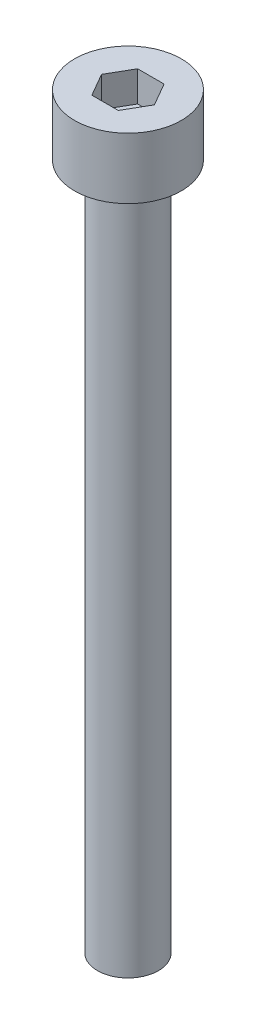
ISO-10303-21;
HEADER;
FILE_DESCRIPTION(('STEP AP214'),'2;1');
FILE_NAME('part.step','',(''),(''),'','','');
FILE_SCHEMA(('AUTOMOTIVE_DESIGN { 1 0 10303 214 1 1 1 1 }'));
ENDSEC;
DATA;
#1=APPLICATION_CONTEXT('core data for automotive mechanical design processes');
#2=APPLICATION_PROTOCOL_DEFINITION('international standard','automotive_design',2000,#1);
#3=PRODUCT_CONTEXT('',#1,'mechanical');
#4=PRODUCT('Part','Part','',(#3));
#5=PRODUCT_RELATED_PRODUCT_CATEGORY('part','',(#4));
#6=PRODUCT_DEFINITION_FORMATION('','',#4);
#7=PRODUCT_DEFINITION_CONTEXT('part definition',#1,'design');
#8=PRODUCT_DEFINITION('design','',#6,#7);
#9=PRODUCT_DEFINITION_SHAPE('','',#8);
#10=(LENGTH_UNIT() NAMED_UNIT(*) SI_UNIT(.MILLI.,.METRE.));
#11=(NAMED_UNIT(*) PLANE_ANGLE_UNIT() SI_UNIT($,.RADIAN.));
#12=(NAMED_UNIT(*) SI_UNIT($,.STERADIAN.) SOLID_ANGLE_UNIT());
#13=UNCERTAINTY_MEASURE_WITH_UNIT(LENGTH_MEASURE(1.E-05),#10,'distance_accuracy_value','');
#14=(GEOMETRIC_REPRESENTATION_CONTEXT(3) GLOBAL_UNCERTAINTY_ASSIGNED_CONTEXT((#13)) GLOBAL_UNIT_ASSIGNED_CONTEXT((#10,
#11,#12)) REPRESENTATION_CONTEXT('',''));
#15=CARTESIAN_POINT('',(0.,0.,0.));
#16=DIRECTION('',(0.,0.,1.));
#17=DIRECTION('',(1.,0.,0.));
#18=AXIS2_PLACEMENT_3D('',#15,#16,#17);
#19=CARTESIAN_POINT('',(0.,4.,0.));
#20=DIRECTION('',(0.,-1.,0.));
#21=DIRECTION('',(0.,0.,-1.));
#22=AXIS2_PLACEMENT_3D('',#19,#20,#21);
#23=CYLINDRICAL_SURFACE('',#22,3.5);
#24=CARTESIAN_POINT('',(0.,4.,0.));
#25=DIRECTION('',(0.,1.,0.));
#26=DIRECTION('',(0.,0.,1.));
#27=AXIS2_PLACEMENT_3D('',#24,#25,#26);
#28=CIRCLE('',#27,3.5);
#29=CARTESIAN_POINT('',(0.,4.,3.5));
#30=VERTEX_POINT('',#29);
#31=EDGE_CURVE('E43',#30,#30,#28,.T.);
#32=ORIENTED_EDGE('',*,*,#31,.F.);
#33=EDGE_LOOP('',(#32));
#34=FACE_BOUND('',#33,.T.);
#35=CARTESIAN_POINT('',(0.,0.,0.));
#36=DIRECTION('',(0.,1.,0.));
#37=DIRECTION('',(0.,0.,1.));
#38=AXIS2_PLACEMENT_3D('',#35,#36,#37);
#39=CIRCLE('',#38,3.5);
#40=CARTESIAN_POINT('',(0.,0.,3.5));
#41=VERTEX_POINT('',#40);
#42=EDGE_CURVE('E38',#41,#41,#39,.T.);
#43=ORIENTED_EDGE('',*,*,#42,.T.);
#44=EDGE_LOOP('',(#43));
#45=FACE_BOUND('',#44,.T.);
#46=ADVANCED_FACE('F35',(#34,#45),#23,.T.);
#47=CARTESIAN_POINT('',(0.,4.,0.));
#48=DIRECTION('',(0.,1.,0.));
#49=DIRECTION('',(0.,0.,1.));
#50=AXIS2_PLACEMENT_3D('',#47,#48,#49);
#51=PLANE('',#50);
#52=DIRECTION('',(0.5,0.,-0.866025403784439));
#53=VECTOR('',#52,1.);
#54=CARTESIAN_POINT('',(0.866025403784438,4.,1.5));
#55=LINE('',#54,#53);
#56=CARTESIAN_POINT('',(0.866025403784438,4.,1.5));
#57=VERTEX_POINT('',#56);
#58=CARTESIAN_POINT('',(1.73205080756888,4.,0.));
#59=VERTEX_POINT('',#58);
#60=EDGE_CURVE('E51',#57,#59,#55,.T.);
#61=ORIENTED_EDGE('',*,*,#60,.F.);
#62=DIRECTION('',(1.,0.,0.));
#63=VECTOR('',#62,1.);
#64=CARTESIAN_POINT('',(-0.866025403784439,4.,1.5));
#65=LINE('',#64,#63);
#66=CARTESIAN_POINT('',(-0.866025403784439,4.,1.5));
#67=VERTEX_POINT('',#66);
#68=EDGE_CURVE('E135',#67,#57,#65,.T.);
#69=ORIENTED_EDGE('',*,*,#68,.F.);
#70=DIRECTION('',(0.5,0.,0.866025403784438));
#71=VECTOR('',#70,1.);
#72=CARTESIAN_POINT('',(-1.73205080756888,4.,0.));
#73=LINE('',#72,#71);
#74=CARTESIAN_POINT('',(-1.73205080756888,4.,0.));
#75=VERTEX_POINT('',#74);
#76=EDGE_CURVE('E133',#75,#67,#73,.T.);
#77=ORIENTED_EDGE('',*,*,#76,.F.);
#78=DIRECTION('',(-0.5,0.,0.866025403784439));
#79=VECTOR('',#78,1.);
#80=CARTESIAN_POINT('',(-0.866025403784439,4.,-1.5));
#81=LINE('',#80,#79);
#82=CARTESIAN_POINT('',(-0.866025403784439,4.,-1.5));
#83=VERTEX_POINT('',#82);
#84=EDGE_CURVE('E99',#83,#75,#81,.T.);
#85=ORIENTED_EDGE('',*,*,#84,.F.);
#86=DIRECTION('',(-1.,0.,0.));
#87=VECTOR('',#86,1.);
#88=CARTESIAN_POINT('',(0.866025403784438,4.,-1.5));
#89=LINE('',#88,#87);
#90=CARTESIAN_POINT('',(0.866025403784438,4.,-1.5));
#91=VERTEX_POINT('',#90);
#92=EDGE_CURVE('E129',#91,#83,#89,.T.);
#93=ORIENTED_EDGE('',*,*,#92,.F.);
#94=DIRECTION('',(-0.5,0.,-0.866025403784439));
#95=VECTOR('',#94,1.);
#96=CARTESIAN_POINT('',(1.73205080756888,4.,0.));
#97=LINE('',#96,#95);
#98=EDGE_CURVE('E125',#59,#91,#97,.T.);
#99=ORIENTED_EDGE('',*,*,#98,.F.);
#100=EDGE_LOOP('',(#61,#69,#77,#85,#93,#99));
#101=FACE_BOUND('',#100,.T.);
#102=ORIENTED_EDGE('',*,*,#31,.T.);
#103=EDGE_LOOP('',(#102));
#104=FACE_BOUND('',#103,.T.);
#105=ADVANCED_FACE('F153',(#101,#104),#51,.T.);
#106=CARTESIAN_POINT('',(0.,0.,0.));
#107=DIRECTION('',(0.,1.,0.));
#108=DIRECTION('',(0.,0.,1.));
#109=AXIS2_PLACEMENT_3D('',#106,#107,#108);
#110=PLANE('',#109);
#111=CARTESIAN_POINT('',(0.,0.,0.));
#112=DIRECTION('',(0.,-1.,0.));
#113=DIRECTION('',(0.,0.,-1.));
#114=AXIS2_PLACEMENT_3D('',#111,#112,#113);
#115=CIRCLE('',#114,2.);
#116=CARTESIAN_POINT('',(0.,0.,-2.));
#117=VERTEX_POINT('',#116);
#118=EDGE_CURVE('E11',#117,#117,#115,.T.);
#119=ORIENTED_EDGE('',*,*,#118,.F.);
#120=EDGE_LOOP('',(#119));
#121=FACE_BOUND('',#120,.T.);
#122=ORIENTED_EDGE('',*,*,#42,.F.);
#123=EDGE_LOOP('',(#122));
#124=FACE_BOUND('',#123,.T.);
#125=ADVANCED_FACE('F150',(#121,#124),#110,.F.);
#126=CARTESIAN_POINT('',(0.866025403784438,2.,1.5));
#127=DIRECTION('',(0.866025403784439,0.,0.5));
#128=DIRECTION('',(0.5,0.,-0.866025403784439));
#129=AXIS2_PLACEMENT_3D('',#126,#127,#128);
#130=PLANE('',#129);
#131=ORIENTED_EDGE('',*,*,#60,.T.);
#132=DIRECTION('',(0.,1.,0.));
#133=VECTOR('',#132,1.);
#134=CARTESIAN_POINT('',(1.73205080756888,2.,0.));
#135=LINE('',#134,#133);
#136=CARTESIAN_POINT('',(1.73205080756888,2.,0.));
#137=VERTEX_POINT('',#136);
#138=EDGE_CURVE('E81',#137,#59,#135,.T.);
#139=ORIENTED_EDGE('',*,*,#138,.F.);
#140=DIRECTION('',(0.5,0.,-0.866025403784439));
#141=VECTOR('',#140,1.);
#142=CARTESIAN_POINT('',(0.866025403784438,2.,1.5));
#143=LINE('',#142,#141);
#144=CARTESIAN_POINT('',(0.866025403784438,2.,1.5));
#145=VERTEX_POINT('',#144);
#146=EDGE_CURVE('E137',#145,#137,#143,.T.);
#147=ORIENTED_EDGE('',*,*,#146,.F.);
#148=DIRECTION('',(0.,1.,0.));
#149=VECTOR('',#148,1.);
#150=CARTESIAN_POINT('',(0.866025403784438,2.,1.5));
#151=LINE('',#150,#149);
#152=EDGE_CURVE('E59',#145,#57,#151,.T.);
#153=ORIENTED_EDGE('',*,*,#152,.T.);
#154=EDGE_LOOP('',(#131,#139,#147,#153));
#155=FACE_BOUND('',#154,.T.);
#156=ADVANCED_FACE('F152',(#155),#130,.F.);
#157=CARTESIAN_POINT('',(-0.866025403784439,2.,1.5));
#158=DIRECTION('',(0.,0.,1.));
#159=DIRECTION('',(1.,0.,0.));
#160=AXIS2_PLACEMENT_3D('',#157,#158,#159);
#161=PLANE('',#160);
#162=ORIENTED_EDGE('',*,*,#68,.T.);
#163=ORIENTED_EDGE('',*,*,#152,.F.);
#164=DIRECTION('',(1.,0.,0.));
#165=VECTOR('',#164,1.);
#166=CARTESIAN_POINT('',(-0.866025403784439,2.,1.5));
#167=LINE('',#166,#165);
#168=CARTESIAN_POINT('',(-0.866025403784439,2.,1.5));
#169=VERTEX_POINT('',#168);
#170=EDGE_CURVE('E111',#169,#145,#167,.T.);
#171=ORIENTED_EDGE('',*,*,#170,.F.);
#172=DIRECTION('',(0.,1.,0.));
#173=VECTOR('',#172,1.);
#174=CARTESIAN_POINT('',(-0.866025403784439,2.,1.5));
#175=LINE('',#174,#173);
#176=EDGE_CURVE('E103',#169,#67,#175,.T.);
#177=ORIENTED_EDGE('',*,*,#176,.T.);
#178=EDGE_LOOP('',(#162,#163,#171,#177));
#179=FACE_BOUND('',#178,.T.);
#180=ADVANCED_FACE('F159',(#179),#161,.F.);
#181=CARTESIAN_POINT('',(-1.73205080756888,2.,0.));
#182=DIRECTION('',(-0.866025403784439,0.,0.5));
#183=DIRECTION('',(0.5,0.,0.866025403784438));
#184=AXIS2_PLACEMENT_3D('',#181,#182,#183);
#185=PLANE('',#184);
#186=ORIENTED_EDGE('',*,*,#76,.T.);
#187=ORIENTED_EDGE('',*,*,#176,.F.);
#188=DIRECTION('',(0.5,0.,0.866025403784438));
#189=VECTOR('',#188,1.);
#190=CARTESIAN_POINT('',(-1.73205080756888,2.,0.));
#191=LINE('',#190,#189);
#192=CARTESIAN_POINT('',(-1.73205080756888,2.,0.));
#193=VERTEX_POINT('',#192);
#194=EDGE_CURVE('E107',#193,#169,#191,.T.);
#195=ORIENTED_EDGE('',*,*,#194,.F.);
#196=DIRECTION('',(0.,1.,0.));
#197=VECTOR('',#196,1.);
#198=CARTESIAN_POINT('',(-1.73205080756888,2.,0.));
#199=LINE('',#198,#197);
#200=EDGE_CURVE('E92',#193,#75,#199,.T.);
#201=ORIENTED_EDGE('',*,*,#200,.T.);
#202=EDGE_LOOP('',(#186,#187,#195,#201));
#203=FACE_BOUND('',#202,.T.);
#204=ADVANCED_FACE('F108',(#203),#185,.F.);
#205=CARTESIAN_POINT('',(-0.866025403784439,2.,-1.5));
#206=DIRECTION('',(-0.866025403784439,0.,-0.5));
#207=DIRECTION('',(-0.5,0.,0.866025403784439));
#208=AXIS2_PLACEMENT_3D('',#205,#206,#207);
#209=PLANE('',#208);
#210=ORIENTED_EDGE('',*,*,#84,.T.);
#211=ORIENTED_EDGE('',*,*,#200,.F.);
#212=DIRECTION('',(-0.5,0.,0.866025403784439));
#213=VECTOR('',#212,1.);
#214=CARTESIAN_POINT('',(-0.866025403784439,2.,-1.5));
#215=LINE('',#214,#213);
#216=CARTESIAN_POINT('',(-0.866025403784439,2.,-1.5));
#217=VERTEX_POINT('',#216);
#218=EDGE_CURVE('E96',#217,#193,#215,.T.);
#219=ORIENTED_EDGE('',*,*,#218,.F.);
#220=DIRECTION('',(0.,1.,0.));
#221=VECTOR('',#220,1.);
#222=CARTESIAN_POINT('',(-0.866025403784439,2.,-1.5));
#223=LINE('',#222,#221);
#224=EDGE_CURVE('E104',#217,#83,#223,.T.);
#225=ORIENTED_EDGE('',*,*,#224,.T.);
#226=EDGE_LOOP('',(#210,#211,#219,#225));
#227=FACE_BOUND('',#226,.T.);
#228=ADVANCED_FACE('F94',(#227),#209,.F.);
#229=CARTESIAN_POINT('',(0.866025403784438,2.,-1.5));
#230=DIRECTION('',(0.,0.,-1.));
#231=DIRECTION('',(-1.,0.,0.));
#232=AXIS2_PLACEMENT_3D('',#229,#230,#231);
#233=PLANE('',#232);
#234=ORIENTED_EDGE('',*,*,#92,.T.);
#235=ORIENTED_EDGE('',*,*,#224,.F.);
#236=DIRECTION('',(-1.,0.,0.));
#237=VECTOR('',#236,1.);
#238=CARTESIAN_POINT('',(0.866025403784438,2.,-1.5));
#239=LINE('',#238,#237);
#240=CARTESIAN_POINT('',(0.866025403784438,2.,-1.5));
#241=VERTEX_POINT('',#240);
#242=EDGE_CURVE('E117',#241,#217,#239,.T.);
#243=ORIENTED_EDGE('',*,*,#242,.F.);
#244=DIRECTION('',(0.,1.,0.));
#245=VECTOR('',#244,1.);
#246=CARTESIAN_POINT('',(0.866025403784438,2.,-1.5));
#247=LINE('',#246,#245);
#248=EDGE_CURVE('E141',#241,#91,#247,.T.);
#249=ORIENTED_EDGE('',*,*,#248,.T.);
#250=EDGE_LOOP('',(#234,#235,#243,#249));
#251=FACE_BOUND('',#250,.T.);
#252=ADVANCED_FACE('F204',(#251),#233,.F.);
#253=CARTESIAN_POINT('',(1.73205080756888,2.,0.));
#254=DIRECTION('',(0.866025403784439,0.,-0.5));
#255=DIRECTION('',(-0.5,0.,-0.866025403784439));
#256=AXIS2_PLACEMENT_3D('',#253,#254,#255);
#257=PLANE('',#256);
#258=ORIENTED_EDGE('',*,*,#98,.T.);
#259=ORIENTED_EDGE('',*,*,#248,.F.);
#260=DIRECTION('',(-0.5,0.,-0.866025403784439));
#261=VECTOR('',#260,1.);
#262=CARTESIAN_POINT('',(1.73205080756888,2.,0.));
#263=LINE('',#262,#261);
#264=EDGE_CURVE('E119',#137,#241,#263,.T.);
#265=ORIENTED_EDGE('',*,*,#264,.F.);
#266=ORIENTED_EDGE('',*,*,#138,.T.);
#267=EDGE_LOOP('',(#258,#259,#265,#266));
#268=FACE_BOUND('',#267,.T.);
#269=ADVANCED_FACE('F213',(#268),#257,.F.);
#270=CARTESIAN_POINT('',(0.,2.,0.));
#271=DIRECTION('',(0.,1.,0.));
#272=DIRECTION('',(0.,0.,1.));
#273=AXIS2_PLACEMENT_3D('',#270,#271,#272);
#274=PLANE('',#273);
#275=ORIENTED_EDGE('',*,*,#146,.T.);
#276=ORIENTED_EDGE('',*,*,#264,.T.);
#277=ORIENTED_EDGE('',*,*,#242,.T.);
#278=ORIENTED_EDGE('',*,*,#218,.T.);
#279=ORIENTED_EDGE('',*,*,#194,.T.);
#280=ORIENTED_EDGE('',*,*,#170,.T.);
#281=EDGE_LOOP('',(#275,#276,#277,#278,#279,#280));
#282=FACE_BOUND('',#281,.T.);
#283=ADVANCED_FACE('F114',(#282),#274,.T.);
#284=CARTESIAN_POINT('',(0.,-45.,0.));
#285=DIRECTION('',(0.,1.,0.));
#286=DIRECTION('',(0.,0.,1.));
#287=AXIS2_PLACEMENT_3D('',#284,#285,#286);
#288=CYLINDRICAL_SURFACE('',#287,2.);
#289=CARTESIAN_POINT('',(0.,-45.,0.));
#290=DIRECTION('',(0.,-1.,0.));
#291=DIRECTION('',(0.,0.,-1.));
#292=AXIS2_PLACEMENT_3D('',#289,#290,#291);
#293=CIRCLE('',#292,2.);
#294=CARTESIAN_POINT('',(0.,-45.,-2.));
#295=VERTEX_POINT('',#294);
#296=EDGE_CURVE('E126',#295,#295,#293,.T.);
#297=ORIENTED_EDGE('',*,*,#296,.F.);
#298=EDGE_LOOP('',(#297));
#299=FACE_BOUND('',#298,.T.);
#300=ORIENTED_EDGE('',*,*,#118,.T.);
#301=EDGE_LOOP('',(#300));
#302=FACE_BOUND('',#301,.T.);
#303=ADVANCED_FACE('F231',(#299,#302),#288,.T.);
#304=CARTESIAN_POINT('',(0.,-45.,0.));
#305=DIRECTION('',(0.,-1.,0.));
#306=DIRECTION('',(0.,0.,-1.));
#307=AXIS2_PLACEMENT_3D('',#304,#305,#306);
#308=PLANE('',#307);
#309=ORIENTED_EDGE('',*,*,#296,.T.);
#310=EDGE_LOOP('',(#309));
#311=FACE_BOUND('',#310,.T.);
#312=ADVANCED_FACE('F244',(#311),#308,.T.);
#313=CLOSED_SHELL('',(#46,#105,#125,#156,#180,#204,#228,#252,#269,#283,#303,#312));
#314=MANIFOLD_SOLID_BREP('B2',#313);
#315=ADVANCED_BREP_SHAPE_REPRESENTATION('',(#18,#314),#14);
#316=SHAPE_DEFINITION_REPRESENTATION(#9,#315);
ENDSEC;
END-ISO-10303-21;
